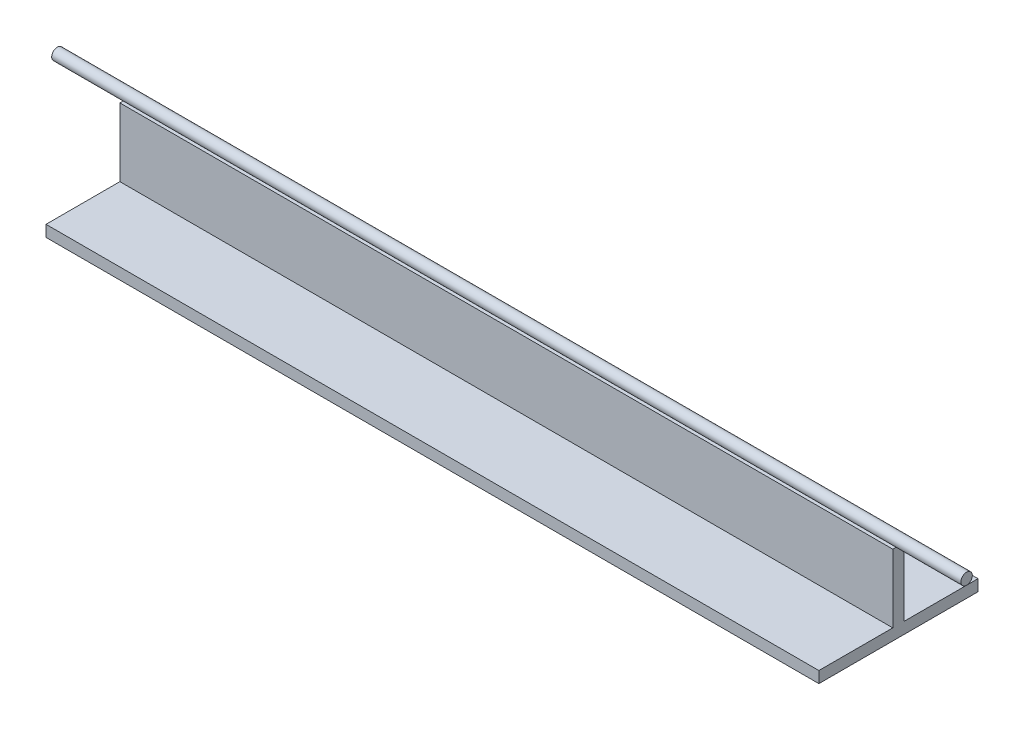
ISO-10303-21;
HEADER;
FILE_DESCRIPTION(('STEP AP214'),'2;1');
FILE_NAME('part.step','',(''),(''),'','','');
FILE_SCHEMA(('AUTOMOTIVE_DESIGN { 1 0 10303 214 1 1 1 1 }'));
ENDSEC;
DATA;
#1=APPLICATION_CONTEXT('core data for automotive mechanical design processes');
#2=APPLICATION_PROTOCOL_DEFINITION('international standard','automotive_design',2000,#1);
#3=PRODUCT_CONTEXT('',#1,'mechanical');
#4=PRODUCT('Part','Part','',(#3));
#5=PRODUCT_RELATED_PRODUCT_CATEGORY('part','',(#4));
#6=PRODUCT_DEFINITION_FORMATION('','',#4);
#7=PRODUCT_DEFINITION_CONTEXT('part definition',#1,'design');
#8=PRODUCT_DEFINITION('design','',#6,#7);
#9=PRODUCT_DEFINITION_SHAPE('','',#8);
#10=(LENGTH_UNIT() NAMED_UNIT(*) SI_UNIT(.MILLI.,.METRE.));
#11=(NAMED_UNIT(*) PLANE_ANGLE_UNIT() SI_UNIT($,.RADIAN.));
#12=(NAMED_UNIT(*) SI_UNIT($,.STERADIAN.) SOLID_ANGLE_UNIT());
#13=UNCERTAINTY_MEASURE_WITH_UNIT(LENGTH_MEASURE(1.E-05),#10,'distance_accuracy_value','');
#14=(GEOMETRIC_REPRESENTATION_CONTEXT(3) GLOBAL_UNCERTAINTY_ASSIGNED_CONTEXT((#13)) GLOBAL_UNIT_ASSIGNED_CONTEXT((#10,
#11,#12)) REPRESENTATION_CONTEXT('',''));
#15=CARTESIAN_POINT('',(0.,0.,0.));
#16=DIRECTION('',(0.,0.,1.));
#17=DIRECTION('',(1.,0.,0.));
#18=AXIS2_PLACEMENT_3D('',#15,#16,#17);
#19=CARTESIAN_POINT('',(-200.,32.5,0.));
#20=DIRECTION('',(1.,0.,0.));
#21=DIRECTION('',(0.,0.,-1.));
#22=AXIS2_PLACEMENT_3D('',#19,#20,#21);
#23=CYLINDRICAL_SURFACE('',#22,2.5);
#24=CARTESIAN_POINT('',(-200.,32.5,0.));
#25=DIRECTION('',(1.,0.,0.));
#26=DIRECTION('',(0.,0.,-1.));
#27=AXIS2_PLACEMENT_3D('',#24,#25,#26);
#28=CIRCLE('',#27,2.5);
#29=CARTESIAN_POINT('',(-200.,32.5,-2.5));
#30=VERTEX_POINT('',#29);
#31=EDGE_CURVE('E11',#30,#30,#28,.T.);
#32=ORIENTED_EDGE('',*,*,#31,.T.);
#33=EDGE_LOOP('',(#32));
#34=FACE_BOUND('',#33,.T.);
#35=CARTESIAN_POINT('',(200.,32.5,0.));
#36=DIRECTION('',(1.,0.,0.));
#37=DIRECTION('',(0.,0.,-1.));
#38=AXIS2_PLACEMENT_3D('',#35,#36,#37);
#39=CIRCLE('',#38,2.5);
#40=CARTESIAN_POINT('',(200.,32.5,-2.5));
#41=VERTEX_POINT('',#40);
#42=EDGE_CURVE('E47',#41,#41,#39,.T.);
#43=ORIENTED_EDGE('',*,*,#42,.F.);
#44=EDGE_LOOP('',(#43));
#45=FACE_BOUND('',#44,.T.);
#46=ADVANCED_FACE('F41',(#34,#45),#23,.T.);
#47=CARTESIAN_POINT('',(-200.,32.5,0.));
#48=DIRECTION('',(1.,0.,0.));
#49=DIRECTION('',(0.,0.,-1.));
#50=AXIS2_PLACEMENT_3D('',#47,#48,#49);
#51=PLANE('',#50);
#52=ORIENTED_EDGE('',*,*,#31,.F.);
#53=EDGE_LOOP('',(#52));
#54=FACE_BOUND('',#53,.T.);
#55=ADVANCED_FACE('F56',(#54),#51,.F.);
#56=CARTESIAN_POINT('',(200.,32.5,0.));
#57=DIRECTION('',(1.,0.,0.));
#58=DIRECTION('',(0.,0.,-1.));
#59=AXIS2_PLACEMENT_3D('',#56,#57,#58);
#60=PLANE('',#59);
#61=ORIENTED_EDGE('',*,*,#42,.T.);
#62=EDGE_LOOP('',(#61));
#63=FACE_BOUND('',#62,.T.);
#64=ADVANCED_FACE('F53',(#63),#60,.T.);
#65=CLOSED_SHELL('',(#46,#55,#64));
#66=MANIFOLD_SOLID_BREP('B2',#65);
#67=CARTESIAN_POINT('',(170.,30.,2.5));
#68=DIRECTION('',(-1.,0.,0.));
#69=DIRECTION('',(0.,0.,1.));
#70=AXIS2_PLACEMENT_3D('',#67,#68,#69);
#71=PLANE('',#70);
#72=DIRECTION('',(0.,-1.,0.));
#73=VECTOR('',#72,1.);
#74=CARTESIAN_POINT('',(170.,30.,2.5));
#75=LINE('',#74,#73);
#76=CARTESIAN_POINT('',(170.,30.,2.5));
#77=VERTEX_POINT('',#76);
#78=CARTESIAN_POINT('',(170.,0.,2.5));
#79=VERTEX_POINT('',#78);
#80=EDGE_CURVE('E230',#77,#79,#75,.T.);
#81=ORIENTED_EDGE('',*,*,#80,.T.);
#82=DIRECTION('',(0.,0.,1.));
#83=VECTOR('',#82,1.);
#84=CARTESIAN_POINT('',(170.,0.,35.));
#85=LINE('',#84,#83);
#86=CARTESIAN_POINT('',(170.,0.,35.));
#87=VERTEX_POINT('',#86);
#88=EDGE_CURVE('E166',#79,#87,#85,.T.);
#89=ORIENTED_EDGE('',*,*,#88,.T.);
#90=DIRECTION('',(0.,1.,0.));
#91=VECTOR('',#90,1.);
#92=CARTESIAN_POINT('',(170.,-5.,35.));
#93=LINE('',#92,#91);
#94=CARTESIAN_POINT('',(170.,-5.,35.));
#95=VERTEX_POINT('',#94);
#96=EDGE_CURVE('E148',#95,#87,#93,.T.);
#97=ORIENTED_EDGE('',*,*,#96,.F.);
#98=DIRECTION('',(0.,0.,1.));
#99=VECTOR('',#98,1.);
#100=CARTESIAN_POINT('',(170.,-5.,35.));
#101=LINE('',#100,#99);
#102=CARTESIAN_POINT('',(170.,-5.,-35.));
#103=VERTEX_POINT('',#102);
#104=EDGE_CURVE('E154',#103,#95,#101,.T.);
#105=ORIENTED_EDGE('',*,*,#104,.F.);
#106=DIRECTION('',(0.,1.,0.));
#107=VECTOR('',#106,1.);
#108=CARTESIAN_POINT('',(170.,-5.,-35.));
#109=LINE('',#108,#107);
#110=CARTESIAN_POINT('',(170.,0.,-35.));
#111=VERTEX_POINT('',#110);
#112=EDGE_CURVE('E213',#103,#111,#109,.T.);
#113=ORIENTED_EDGE('',*,*,#112,.T.);
#114=CARTESIAN_POINT('',(170.,0.,-2.5));
#115=VERTEX_POINT('',#114);
#116=EDGE_CURVE('E177',#111,#115,#85,.T.);
#117=ORIENTED_EDGE('',*,*,#116,.T.);
#118=DIRECTION('',(0.,-1.,0.));
#119=VECTOR('',#118,1.);
#120=CARTESIAN_POINT('',(170.,30.,-2.5));
#121=LINE('',#120,#119);
#122=CARTESIAN_POINT('',(170.,30.,-2.5));
#123=VERTEX_POINT('',#122);
#124=EDGE_CURVE('E39',#123,#115,#121,.T.);
#125=ORIENTED_EDGE('',*,*,#124,.F.);
#126=DIRECTION('',(0.,0.,-1.));
#127=VECTOR('',#126,1.);
#128=CARTESIAN_POINT('',(170.,30.,2.5));
#129=LINE('',#128,#127);
#130=EDGE_CURVE('E222',#77,#123,#129,.T.);
#131=ORIENTED_EDGE('',*,*,#130,.F.);
#132=EDGE_LOOP('',(#81,#89,#97,#105,#113,#117,#125,#131));
#133=FACE_BOUND('',#132,.T.);
#134=ADVANCED_FACE('F82',(#133),#71,.F.);
#135=CARTESIAN_POINT('',(-170.,30.,-2.5));
#136=DIRECTION('',(0.,0.,1.));
#137=DIRECTION('',(1.,0.,0.));
#138=AXIS2_PLACEMENT_3D('',#135,#136,#137);
#139=PLANE('',#138);
#140=DIRECTION('',(-1.,0.,0.));
#141=VECTOR('',#140,1.);
#142=CARTESIAN_POINT('',(-170.,0.,-2.5));
#143=LINE('',#142,#141);
#144=CARTESIAN_POINT('',(-170.,0.,-2.5));
#145=VERTEX_POINT('',#144);
#146=EDGE_CURVE('E168',#115,#145,#143,.T.);
#147=ORIENTED_EDGE('',*,*,#146,.T.);
#148=DIRECTION('',(0.,-1.,0.));
#149=VECTOR('',#148,1.);
#150=CARTESIAN_POINT('',(-170.,30.,-2.5));
#151=LINE('',#150,#149);
#152=CARTESIAN_POINT('',(-170.,30.,-2.5));
#153=VERTEX_POINT('',#152);
#154=EDGE_CURVE('E91',#153,#145,#151,.T.);
#155=ORIENTED_EDGE('',*,*,#154,.F.);
#156=DIRECTION('',(-1.,0.,0.));
#157=VECTOR('',#156,1.);
#158=CARTESIAN_POINT('',(-170.,30.,-2.5));
#159=LINE('',#158,#157);
#160=EDGE_CURVE('E220',#123,#153,#159,.T.);
#161=ORIENTED_EDGE('',*,*,#160,.F.);
#162=ORIENTED_EDGE('',*,*,#124,.T.);
#163=EDGE_LOOP('',(#147,#155,#161,#162));
#164=FACE_BOUND('',#163,.T.);
#165=ADVANCED_FACE('F219',(#164),#139,.F.);
#166=CARTESIAN_POINT('',(-170.,30.,2.5));
#167=DIRECTION('',(1.,0.,0.));
#168=DIRECTION('',(0.,0.,-1.));
#169=AXIS2_PLACEMENT_3D('',#166,#167,#168);
#170=PLANE('',#169);
#171=ORIENTED_EDGE('',*,*,#154,.T.);
#172=DIRECTION('',(0.,0.,-1.));
#173=VECTOR('',#172,1.);
#174=CARTESIAN_POINT('',(-170.,0.,35.));
#175=LINE('',#174,#173);
#176=CARTESIAN_POINT('',(-170.,0.,-35.));
#177=VERTEX_POINT('',#176);
#178=EDGE_CURVE('E189',#145,#177,#175,.T.);
#179=ORIENTED_EDGE('',*,*,#178,.T.);
#180=DIRECTION('',(0.,1.,0.));
#181=VECTOR('',#180,1.);
#182=CARTESIAN_POINT('',(-170.,-5.,-35.));
#183=LINE('',#182,#181);
#184=CARTESIAN_POINT('',(-170.,-5.,-35.));
#185=VERTEX_POINT('',#184);
#186=EDGE_CURVE('E173',#185,#177,#183,.T.);
#187=ORIENTED_EDGE('',*,*,#186,.F.);
#188=DIRECTION('',(0.,0.,-1.));
#189=VECTOR('',#188,1.);
#190=CARTESIAN_POINT('',(-170.,-5.,35.));
#191=LINE('',#190,#189);
#192=CARTESIAN_POINT('',(-170.,-5.,35.));
#193=VERTEX_POINT('',#192);
#194=EDGE_CURVE('E153',#193,#185,#191,.T.);
#195=ORIENTED_EDGE('',*,*,#194,.F.);
#196=DIRECTION('',(0.,1.,0.));
#197=VECTOR('',#196,1.);
#198=CARTESIAN_POINT('',(-170.,-5.,35.));
#199=LINE('',#198,#197);
#200=CARTESIAN_POINT('',(-170.,0.,35.));
#201=VERTEX_POINT('',#200);
#202=EDGE_CURVE('E150',#193,#201,#199,.T.);
#203=ORIENTED_EDGE('',*,*,#202,.T.);
#204=CARTESIAN_POINT('',(-170.,0.,2.5));
#205=VERTEX_POINT('',#204);
#206=EDGE_CURVE('E196',#201,#205,#175,.T.);
#207=ORIENTED_EDGE('',*,*,#206,.T.);
#208=DIRECTION('',(0.,-1.,0.));
#209=VECTOR('',#208,1.);
#210=CARTESIAN_POINT('',(-170.,30.,2.5));
#211=LINE('',#210,#209);
#212=CARTESIAN_POINT('',(-170.,30.,2.5));
#213=VERTEX_POINT('',#212);
#214=EDGE_CURVE('E236',#213,#205,#211,.T.);
#215=ORIENTED_EDGE('',*,*,#214,.F.);
#216=DIRECTION('',(0.,0.,1.));
#217=VECTOR('',#216,1.);
#218=CARTESIAN_POINT('',(-170.,30.,2.5));
#219=LINE('',#218,#217);
#220=EDGE_CURVE('E221',#153,#213,#219,.T.);
#221=ORIENTED_EDGE('',*,*,#220,.F.);
#222=EDGE_LOOP('',(#171,#179,#187,#195,#203,#207,#215,#221));
#223=FACE_BOUND('',#222,.T.);
#224=ADVANCED_FACE('F206',(#223),#170,.F.);
#225=CARTESIAN_POINT('',(-170.,30.,2.5));
#226=DIRECTION('',(0.,0.,-1.));
#227=DIRECTION('',(-1.,0.,0.));
#228=AXIS2_PLACEMENT_3D('',#225,#226,#227);
#229=PLANE('',#228);
#230=DIRECTION('',(1.,0.,0.));
#231=VECTOR('',#230,1.);
#232=CARTESIAN_POINT('',(-170.,0.,2.5));
#233=LINE('',#232,#231);
#234=EDGE_CURVE('E171',#205,#79,#233,.T.);
#235=ORIENTED_EDGE('',*,*,#234,.T.);
#236=ORIENTED_EDGE('',*,*,#80,.F.);
#237=DIRECTION('',(1.,0.,0.));
#238=VECTOR('',#237,1.);
#239=CARTESIAN_POINT('',(-170.,30.,2.5));
#240=LINE('',#239,#238);
#241=EDGE_CURVE('E99',#213,#77,#240,.T.);
#242=ORIENTED_EDGE('',*,*,#241,.F.);
#243=ORIENTED_EDGE('',*,*,#214,.T.);
#244=EDGE_LOOP('',(#235,#236,#242,#243));
#245=FACE_BOUND('',#244,.T.);
#246=ADVANCED_FACE('F244',(#245),#229,.F.);
#247=CARTESIAN_POINT('',(0.,30.,0.));
#248=DIRECTION('',(0.,-1.,0.));
#249=DIRECTION('',(0.,0.,-1.));
#250=AXIS2_PLACEMENT_3D('',#247,#248,#249);
#251=PLANE('',#250);
#252=ORIENTED_EDGE('',*,*,#130,.T.);
#253=ORIENTED_EDGE('',*,*,#160,.T.);
#254=ORIENTED_EDGE('',*,*,#220,.T.);
#255=ORIENTED_EDGE('',*,*,#241,.T.);
#256=EDGE_LOOP('',(#252,#253,#254,#255));
#257=FACE_BOUND('',#256,.T.);
#258=ADVANCED_FACE('F224',(#257),#251,.F.);
#259=CARTESIAN_POINT('',(0.,0.,0.));
#260=DIRECTION('',(0.,-1.,0.));
#261=DIRECTION('',(0.,0.,-1.));
#262=AXIS2_PLACEMENT_3D('',#259,#260,#261);
#263=PLANE('',#262);
#264=ORIENTED_EDGE('',*,*,#234,.F.);
#265=ORIENTED_EDGE('',*,*,#206,.F.);
#266=DIRECTION('',(-1.,0.,0.));
#267=VECTOR('',#266,1.);
#268=CARTESIAN_POINT('',(-170.,0.,35.));
#269=LINE('',#268,#267);
#270=EDGE_CURVE('E181',#87,#201,#269,.T.);
#271=ORIENTED_EDGE('',*,*,#270,.F.);
#272=ORIENTED_EDGE('',*,*,#88,.F.);
#273=EDGE_LOOP('',(#264,#265,#271,#272));
#274=FACE_BOUND('',#273,.T.);
#275=ADVANCED_FACE('F246',(#274),#263,.F.);
#276=CARTESIAN_POINT('',(-170.,-5.,35.));
#277=DIRECTION('',(0.,0.,-1.));
#278=DIRECTION('',(-1.,0.,0.));
#279=AXIS2_PLACEMENT_3D('',#276,#277,#278);
#280=PLANE('',#279);
#281=ORIENTED_EDGE('',*,*,#270,.T.);
#282=ORIENTED_EDGE('',*,*,#202,.F.);
#283=DIRECTION('',(-1.,0.,0.));
#284=VECTOR('',#283,1.);
#285=CARTESIAN_POINT('',(-170.,-5.,35.));
#286=LINE('',#285,#284);
#287=EDGE_CURVE('E144',#95,#193,#286,.T.);
#288=ORIENTED_EDGE('',*,*,#287,.F.);
#289=ORIENTED_EDGE('',*,*,#96,.T.);
#290=EDGE_LOOP('',(#281,#282,#288,#289));
#291=FACE_BOUND('',#290,.T.);
#292=ADVANCED_FACE('F146',(#291),#280,.F.);
#293=CARTESIAN_POINT('',(-170.,-5.,-35.));
#294=DIRECTION('',(0.,0.,1.));
#295=DIRECTION('',(1.,0.,0.));
#296=AXIS2_PLACEMENT_3D('',#293,#294,#295);
#297=PLANE('',#296);
#298=DIRECTION('',(1.,0.,0.));
#299=VECTOR('',#298,1.);
#300=CARTESIAN_POINT('',(-170.,0.,-35.));
#301=LINE('',#300,#299);
#302=EDGE_CURVE('E163',#177,#111,#301,.T.);
#303=ORIENTED_EDGE('',*,*,#302,.T.);
#304=ORIENTED_EDGE('',*,*,#112,.F.);
#305=DIRECTION('',(1.,0.,0.));
#306=VECTOR('',#305,1.);
#307=CARTESIAN_POINT('',(-170.,-5.,-35.));
#308=LINE('',#307,#306);
#309=EDGE_CURVE('E159',#185,#103,#308,.T.);
#310=ORIENTED_EDGE('',*,*,#309,.F.);
#311=ORIENTED_EDGE('',*,*,#186,.T.);
#312=EDGE_LOOP('',(#303,#304,#310,#311));
#313=FACE_BOUND('',#312,.T.);
#314=ADVANCED_FACE('F212',(#313),#297,.F.);
#315=CARTESIAN_POINT('',(0.,-5.,0.));
#316=DIRECTION('',(0.,-1.,0.));
#317=DIRECTION('',(0.,0.,-1.));
#318=AXIS2_PLACEMENT_3D('',#315,#316,#317);
#319=PLANE('',#318);
#320=ORIENTED_EDGE('',*,*,#104,.T.);
#321=ORIENTED_EDGE('',*,*,#287,.T.);
#322=ORIENTED_EDGE('',*,*,#194,.T.);
#323=ORIENTED_EDGE('',*,*,#309,.T.);
#324=EDGE_LOOP('',(#320,#321,#322,#323));
#325=FACE_BOUND('',#324,.T.);
#326=ADVANCED_FACE('F157',(#325),#319,.T.);
#327=ORIENTED_EDGE('',*,*,#146,.F.);
#328=ORIENTED_EDGE('',*,*,#116,.F.);
#329=ORIENTED_EDGE('',*,*,#302,.F.);
#330=ORIENTED_EDGE('',*,*,#178,.F.);
#331=EDGE_LOOP('',(#327,#328,#329,#330));
#332=FACE_BOUND('',#331,.T.);
#333=ADVANCED_FACE('F215',(#332),#263,.F.);
#334=CLOSED_SHELL('',(#134,#165,#224,#246,#258,#275,#292,#314,#326,#333));
#335=MANIFOLD_SOLID_BREP('B6',#334);
#336=ADVANCED_BREP_SHAPE_REPRESENTATION('',(#18,#66,#335),#14);
#337=SHAPE_DEFINITION_REPRESENTATION(#9,#336);
ENDSEC;
END-ISO-10303-21;
